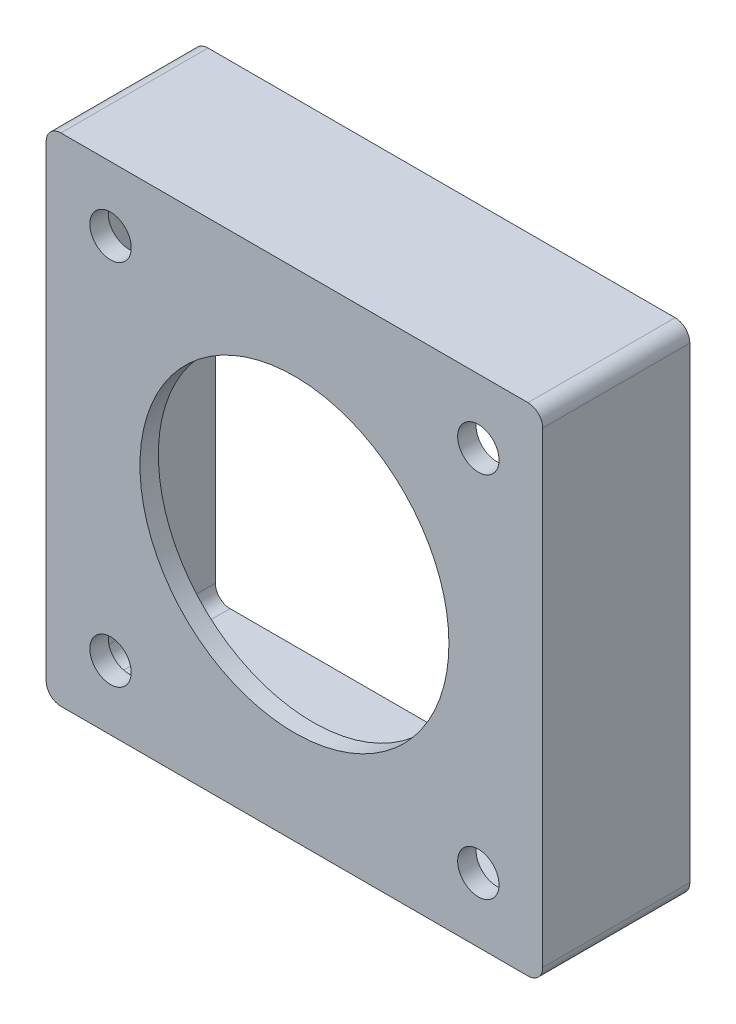
ISO-10303-21;
HEADER;
FILE_DESCRIPTION(('STEP AP214'),'2;1');
FILE_NAME('part.step','',(''),(''),'','','');
FILE_SCHEMA(('AUTOMOTIVE_DESIGN { 1 0 10303 214 1 1 1 1 }'));
ENDSEC;
DATA;
#1=APPLICATION_CONTEXT('core data for automotive mechanical design processes');
#2=APPLICATION_PROTOCOL_DEFINITION('international standard','automotive_design',2000,#1);
#3=PRODUCT_CONTEXT('',#1,'mechanical');
#4=PRODUCT('Part','Part','',(#3));
#5=PRODUCT_RELATED_PRODUCT_CATEGORY('part','',(#4));
#6=PRODUCT_DEFINITION_FORMATION('','',#4);
#7=PRODUCT_DEFINITION_CONTEXT('part definition',#1,'design');
#8=PRODUCT_DEFINITION('design','',#6,#7);
#9=PRODUCT_DEFINITION_SHAPE('','',#8);
#10=(LENGTH_UNIT() NAMED_UNIT(*) SI_UNIT(.MILLI.,.METRE.));
#11=(NAMED_UNIT(*) PLANE_ANGLE_UNIT() SI_UNIT($,.RADIAN.));
#12=(NAMED_UNIT(*) SI_UNIT($,.STERADIAN.) SOLID_ANGLE_UNIT());
#13=UNCERTAINTY_MEASURE_WITH_UNIT(LENGTH_MEASURE(1.E-05),#10,'distance_accuracy_value','');
#14=(GEOMETRIC_REPRESENTATION_CONTEXT(3) GLOBAL_UNCERTAINTY_ASSIGNED_CONTEXT((#13)) GLOBAL_UNIT_ASSIGNED_CONTEXT((#10,
#11,#12)) REPRESENTATION_CONTEXT('',''));
#15=CARTESIAN_POINT('',(0.,0.,0.));
#16=DIRECTION('',(0.,0.,1.));
#17=DIRECTION('',(1.,0.,0.));
#18=AXIS2_PLACEMENT_3D('',#15,#16,#17);
#19=CARTESIAN_POINT('',(0.,0.,25.4));
#20=DIRECTION('',(0.,0.,1.));
#21=DIRECTION('',(1.,0.,0.));
#22=AXIS2_PLACEMENT_3D('',#19,#20,#21);
#23=PLANE('',#22);
#24=CARTESIAN_POINT('',(31.75,31.7499999999996,25.4));
#25=DIRECTION('',(0.,0.,-1.));
#26=DIRECTION('',(-1.,0.,0.));
#27=AXIS2_PLACEMENT_3D('',#24,#25,#26);
#28=CIRCLE('',#27,3.57245345743552);
#29=CARTESIAN_POINT('',(28.1775465425645,31.7499999999996,25.4));
#30=VERTEX_POINT('',#29);
#31=EDGE_CURVE('E295',#30,#30,#28,.T.);
#32=ORIENTED_EDGE('',*,*,#31,.T.);
#33=EDGE_LOOP('',(#32));
#34=FACE_BOUND('',#33,.T.);
#35=CARTESIAN_POINT('',(-31.75,31.7499999999996,25.4));
#36=DIRECTION('',(0.,0.,1.));
#37=DIRECTION('',(1.,0.,0.));
#38=AXIS2_PLACEMENT_3D('',#35,#36,#37);
#39=CIRCLE('',#38,3.57245345743552);
#40=CARTESIAN_POINT('',(-28.1775465425645,31.7499999999996,25.4));
#41=VERTEX_POINT('',#40);
#42=EDGE_CURVE('E298',#41,#41,#39,.T.);
#43=ORIENTED_EDGE('',*,*,#42,.F.);
#44=EDGE_LOOP('',(#43));
#45=FACE_BOUND('',#44,.T.);
#46=DIRECTION('',(1.,0.,0.));
#47=VECTOR('',#46,1.);
#48=CARTESIAN_POINT('',(-42.8625,-42.8625,25.4));
#49=LINE('',#48,#47);
#50=CARTESIAN_POINT('',(-40.3225,-42.8625,25.4));
#51=VERTEX_POINT('',#50);
#52=CARTESIAN_POINT('',(40.3225,-42.8625,25.4));
#53=VERTEX_POINT('',#52);
#54=EDGE_CURVE('E306',#51,#53,#49,.T.);
#55=ORIENTED_EDGE('',*,*,#54,.T.);
#56=CARTESIAN_POINT('',(40.3225,-40.3225,25.4));
#57=DIRECTION('',(0.,0.,1.));
#58=DIRECTION('',(1.,0.,0.));
#59=AXIS2_PLACEMENT_3D('',#56,#57,#58);
#60=CIRCLE('',#59,2.54);
#61=CARTESIAN_POINT('',(42.8625,-40.3225,25.4));
#62=VERTEX_POINT('',#61);
#63=EDGE_CURVE('E209',#53,#62,#60,.T.);
#64=ORIENTED_EDGE('',*,*,#63,.T.);
#65=DIRECTION('',(0.,1.,0.));
#66=VECTOR('',#65,1.);
#67=CARTESIAN_POINT('',(42.8625,42.8625,25.4));
#68=LINE('',#67,#66);
#69=CARTESIAN_POINT('',(42.8625,40.3225,25.4));
#70=VERTEX_POINT('',#69);
#71=EDGE_CURVE('E173',#62,#70,#68,.T.);
#72=ORIENTED_EDGE('',*,*,#71,.T.);
#73=CARTESIAN_POINT('',(40.3225,40.3225,25.4));
#74=DIRECTION('',(0.,0.,1.));
#75=DIRECTION('',(1.,0.,0.));
#76=AXIS2_PLACEMENT_3D('',#73,#74,#75);
#77=CIRCLE('',#76,2.54);
#78=CARTESIAN_POINT('',(40.3225,42.8625,25.4));
#79=VERTEX_POINT('',#78);
#80=EDGE_CURVE('E203',#70,#79,#77,.T.);
#81=ORIENTED_EDGE('',*,*,#80,.T.);
#82=DIRECTION('',(-1.,0.,0.));
#83=VECTOR('',#82,1.);
#84=CARTESIAN_POINT('',(-42.8625,42.8625,25.4));
#85=LINE('',#84,#83);
#86=CARTESIAN_POINT('',(-40.3225,42.8625,25.4));
#87=VERTEX_POINT('',#86);
#88=EDGE_CURVE('E194',#79,#87,#85,.T.);
#89=ORIENTED_EDGE('',*,*,#88,.T.);
#90=CARTESIAN_POINT('',(-40.3225,40.3225,25.4));
#91=DIRECTION('',(0.,0.,1.));
#92=DIRECTION('',(1.,0.,0.));
#93=AXIS2_PLACEMENT_3D('',#90,#91,#92);
#94=CIRCLE('',#93,2.54);
#95=CARTESIAN_POINT('',(-42.8625,40.3225,25.4));
#96=VERTEX_POINT('',#95);
#97=EDGE_CURVE('E205',#87,#96,#94,.T.);
#98=ORIENTED_EDGE('',*,*,#97,.T.);
#99=DIRECTION('',(0.,-1.,0.));
#100=VECTOR('',#99,1.);
#101=CARTESIAN_POINT('',(-42.8625,42.8625,25.4));
#102=LINE('',#101,#100);
#103=CARTESIAN_POINT('',(-42.8625,-40.3225,25.4));
#104=VERTEX_POINT('',#103);
#105=EDGE_CURVE('E183',#96,#104,#102,.T.);
#106=ORIENTED_EDGE('',*,*,#105,.T.);
#107=CARTESIAN_POINT('',(-40.3225,-40.3225,25.4));
#108=DIRECTION('',(0.,0.,1.));
#109=DIRECTION('',(1.,0.,0.));
#110=AXIS2_PLACEMENT_3D('',#107,#108,#109);
#111=CIRCLE('',#110,2.54);
#112=EDGE_CURVE('E207',#104,#51,#111,.T.);
#113=ORIENTED_EDGE('',*,*,#112,.T.);
#114=EDGE_LOOP('',(#55,#64,#72,#81,#89,#98,#106,#113));
#115=FACE_BOUND('',#114,.T.);
#116=CARTESIAN_POINT('',(0.,0.,25.4));
#117=DIRECTION('',(0.,0.,1.));
#118=DIRECTION('',(1.,0.,0.));
#119=AXIS2_PLACEMENT_3D('',#116,#117,#118);
#120=CIRCLE('',#119,26.67);
#121=CARTESIAN_POINT('',(26.67,0.,25.4));
#122=VERTEX_POINT('',#121);
#123=EDGE_CURVE('E301',#122,#122,#120,.T.);
#124=ORIENTED_EDGE('',*,*,#123,.F.);
#125=EDGE_LOOP('',(#124));
#126=FACE_BOUND('',#125,.T.);
#127=CARTESIAN_POINT('',(31.75,-31.7499999999996,25.4));
#128=DIRECTION('',(0.,0.,1.));
#129=DIRECTION('',(-1.,0.,0.));
#130=AXIS2_PLACEMENT_3D('',#127,#128,#129);
#131=CIRCLE('',#130,3.57245345743552);
#132=CARTESIAN_POINT('',(28.1775465425645,-31.7499999999996,25.4));
#133=VERTEX_POINT('',#132);
#134=EDGE_CURVE('E292',#133,#133,#131,.T.);
#135=ORIENTED_EDGE('',*,*,#134,.F.);
#136=EDGE_LOOP('',(#135));
#137=FACE_BOUND('',#136,.T.);
#138=CARTESIAN_POINT('',(-31.75,-31.7499999999996,25.4));
#139=DIRECTION('',(0.,0.,-1.));
#140=DIRECTION('',(1.,0.,0.));
#141=AXIS2_PLACEMENT_3D('',#138,#139,#140);
#142=CIRCLE('',#141,3.57245345743552);
#143=CARTESIAN_POINT('',(-28.1775465425645,-31.7499999999996,25.4));
#144=VERTEX_POINT('',#143);
#145=EDGE_CURVE('E289',#144,#144,#142,.T.);
#146=ORIENTED_EDGE('',*,*,#145,.T.);
#147=EDGE_LOOP('',(#146));
#148=FACE_BOUND('',#147,.T.);
#149=ADVANCED_FACE('F39',(#34,#45,#115,#126,#137,#148),#23,.T.);
#150=CARTESIAN_POINT('',(0.,0.,0.));
#151=DIRECTION('',(0.,0.,1.));
#152=DIRECTION('',(1.,0.,0.));
#153=AXIS2_PLACEMENT_3D('',#150,#151,#152);
#154=PLANE('',#153);
#155=DIRECTION('',(0.,1.,0.));
#156=VECTOR('',#155,1.);
#157=CARTESIAN_POINT('',(-39.0525,39.0525,0.));
#158=LINE('',#157,#156);
#159=CARTESIAN_POINT('',(-39.0525,-36.5125,0.));
#160=VERTEX_POINT('',#159);
#161=CARTESIAN_POINT('',(-39.0525,36.5125,0.));
#162=VERTEX_POINT('',#161);
#163=EDGE_CURVE('E255',#160,#162,#158,.T.);
#164=ORIENTED_EDGE('',*,*,#163,.F.);
#165=CARTESIAN_POINT('',(-36.5125,-36.5125,0.));
#166=DIRECTION('',(0.,0.,1.));
#167=DIRECTION('',(1.,0.,0.));
#168=AXIS2_PLACEMENT_3D('',#165,#166,#167);
#169=CIRCLE('',#168,2.54);
#170=CARTESIAN_POINT('',(-36.5125,-39.0525,0.));
#171=VERTEX_POINT('',#170);
#172=EDGE_CURVE('E47',#160,#171,#169,.T.);
#173=ORIENTED_EDGE('',*,*,#172,.T.);
#174=DIRECTION('',(-1.,0.,0.));
#175=VECTOR('',#174,1.);
#176=CARTESIAN_POINT('',(39.0525,-39.0525,0.));
#177=LINE('',#176,#175);
#178=CARTESIAN_POINT('',(36.5125,-39.0525,0.));
#179=VERTEX_POINT('',#178);
#180=EDGE_CURVE('E254',#179,#171,#177,.T.);
#181=ORIENTED_EDGE('',*,*,#180,.F.);
#182=CARTESIAN_POINT('',(36.5125,-36.5125,0.));
#183=DIRECTION('',(0.,0.,1.));
#184=DIRECTION('',(1.,0.,0.));
#185=AXIS2_PLACEMENT_3D('',#182,#183,#184);
#186=CIRCLE('',#185,2.54);
#187=CARTESIAN_POINT('',(39.0525,-36.5125,0.));
#188=VERTEX_POINT('',#187);
#189=EDGE_CURVE('E249',#179,#188,#186,.T.);
#190=ORIENTED_EDGE('',*,*,#189,.T.);
#191=DIRECTION('',(0.,-1.,0.));
#192=VECTOR('',#191,1.);
#193=CARTESIAN_POINT('',(39.0525,39.0525,0.));
#194=LINE('',#193,#192);
#195=CARTESIAN_POINT('',(39.0525,36.5125,0.));
#196=VERTEX_POINT('',#195);
#197=EDGE_CURVE('E263',#196,#188,#194,.T.);
#198=ORIENTED_EDGE('',*,*,#197,.F.);
#199=CARTESIAN_POINT('',(36.5125,36.5125,0.));
#200=DIRECTION('',(0.,0.,1.));
#201=DIRECTION('',(1.,0.,0.));
#202=AXIS2_PLACEMENT_3D('',#199,#200,#201);
#203=CIRCLE('',#202,2.54);
#204=CARTESIAN_POINT('',(36.5125,39.0525,0.));
#205=VERTEX_POINT('',#204);
#206=EDGE_CURVE('E247',#196,#205,#203,.T.);
#207=ORIENTED_EDGE('',*,*,#206,.T.);
#208=DIRECTION('',(1.,0.,0.));
#209=VECTOR('',#208,1.);
#210=CARTESIAN_POINT('',(39.0525,39.0525,0.));
#211=LINE('',#210,#209);
#212=CARTESIAN_POINT('',(-36.5125,39.0525,0.));
#213=VERTEX_POINT('',#212);
#214=EDGE_CURVE('E274',#213,#205,#211,.T.);
#215=ORIENTED_EDGE('',*,*,#214,.F.);
#216=CARTESIAN_POINT('',(-36.5125,36.5125,0.));
#217=DIRECTION('',(0.,0.,1.));
#218=DIRECTION('',(1.,0.,0.));
#219=AXIS2_PLACEMENT_3D('',#216,#217,#218);
#220=CIRCLE('',#219,2.54);
#221=EDGE_CURVE('E12',#213,#162,#220,.T.);
#222=ORIENTED_EDGE('',*,*,#221,.T.);
#223=EDGE_LOOP('',(#164,#173,#181,#190,#198,#207,#215,#222));
#224=FACE_BOUND('',#223,.T.);
#225=DIRECTION('',(0.,1.,0.));
#226=VECTOR('',#225,1.);
#227=CARTESIAN_POINT('',(42.8625,42.8625,0.));
#228=LINE('',#227,#226);
#229=CARTESIAN_POINT('',(42.8625,-40.3225,0.));
#230=VERTEX_POINT('',#229);
#231=CARTESIAN_POINT('',(42.8625,40.3225,0.));
#232=VERTEX_POINT('',#231);
#233=EDGE_CURVE('E170',#230,#232,#228,.T.);
#234=ORIENTED_EDGE('',*,*,#233,.F.);
#235=CARTESIAN_POINT('',(40.3225,-40.3225,0.));
#236=DIRECTION('',(0.,0.,1.));
#237=DIRECTION('',(1.,0.,0.));
#238=AXIS2_PLACEMENT_3D('',#235,#236,#237);
#239=CIRCLE('',#238,2.54);
#240=CARTESIAN_POINT('',(40.3225,-42.8625,0.));
#241=VERTEX_POINT('',#240);
#242=EDGE_CURVE('E153',#230,#241,#239,.F.);
#243=ORIENTED_EDGE('',*,*,#242,.T.);
#244=DIRECTION('',(1.,0.,0.));
#245=VECTOR('',#244,1.);
#246=CARTESIAN_POINT('',(-42.8625,-42.8625,0.));
#247=LINE('',#246,#245);
#248=CARTESIAN_POINT('',(-40.3225,-42.8625,0.));
#249=VERTEX_POINT('',#248);
#250=EDGE_CURVE('E180',#249,#241,#247,.T.);
#251=ORIENTED_EDGE('',*,*,#250,.F.);
#252=CARTESIAN_POINT('',(-40.3225,-40.3225,0.));
#253=DIRECTION('',(0.,0.,1.));
#254=DIRECTION('',(1.,0.,0.));
#255=AXIS2_PLACEMENT_3D('',#252,#253,#254);
#256=CIRCLE('',#255,2.54);
#257=CARTESIAN_POINT('',(-42.8625,-40.3225,0.));
#258=VERTEX_POINT('',#257);
#259=EDGE_CURVE('E164',#249,#258,#256,.F.);
#260=ORIENTED_EDGE('',*,*,#259,.T.);
#261=DIRECTION('',(0.,-1.,0.));
#262=VECTOR('',#261,1.);
#263=CARTESIAN_POINT('',(-42.8625,42.8625,0.));
#264=LINE('',#263,#262);
#265=CARTESIAN_POINT('',(-42.8625,40.3225,0.));
#266=VERTEX_POINT('',#265);
#267=EDGE_CURVE('E185',#266,#258,#264,.T.);
#268=ORIENTED_EDGE('',*,*,#267,.F.);
#269=CARTESIAN_POINT('',(-40.3225,40.3225,0.));
#270=DIRECTION('',(0.,0.,1.));
#271=DIRECTION('',(1.,0.,0.));
#272=AXIS2_PLACEMENT_3D('',#269,#270,#271);
#273=CIRCLE('',#272,2.54);
#274=CARTESIAN_POINT('',(-40.3225,42.8625,0.));
#275=VERTEX_POINT('',#274);
#276=EDGE_CURVE('E197',#266,#275,#273,.F.);
#277=ORIENTED_EDGE('',*,*,#276,.T.);
#278=DIRECTION('',(-1.,0.,0.));
#279=VECTOR('',#278,1.);
#280=CARTESIAN_POINT('',(-42.8625,42.8625,0.));
#281=LINE('',#280,#279);
#282=CARTESIAN_POINT('',(40.3225,42.8625,0.));
#283=VERTEX_POINT('',#282);
#284=EDGE_CURVE('E179',#283,#275,#281,.T.);
#285=ORIENTED_EDGE('',*,*,#284,.F.);
#286=CARTESIAN_POINT('',(40.3225,40.3225,0.));
#287=DIRECTION('',(0.,0.,1.));
#288=DIRECTION('',(1.,0.,0.));
#289=AXIS2_PLACEMENT_3D('',#286,#287,#288);
#290=CIRCLE('',#289,2.54);
#291=EDGE_CURVE('E174',#283,#232,#290,.F.);
#292=ORIENTED_EDGE('',*,*,#291,.T.);
#293=EDGE_LOOP('',(#234,#243,#251,#260,#268,#277,#285,#292));
#294=FACE_BOUND('',#293,.T.);
#295=ADVANCED_FACE('F177',(#224,#294),#154,.F.);
#296=CARTESIAN_POINT('',(-42.8625,42.8625,25.4));
#297=DIRECTION('',(1.,0.,0.));
#298=DIRECTION('',(0.,1.,0.));
#299=AXIS2_PLACEMENT_3D('',#296,#297,#298);
#300=PLANE('',#299);
#301=ORIENTED_EDGE('',*,*,#267,.T.);
#302=DIRECTION('',(0.,0.,-1.));
#303=VECTOR('',#302,1.);
#304=CARTESIAN_POINT('',(-42.8625,-40.3225,25.4));
#305=LINE('',#304,#303);
#306=EDGE_CURVE('E214',#258,#104,#305,.F.);
#307=ORIENTED_EDGE('',*,*,#306,.T.);
#308=ORIENTED_EDGE('',*,*,#105,.F.);
#309=DIRECTION('',(0.,0.,-1.));
#310=VECTOR('',#309,1.);
#311=CARTESIAN_POINT('',(-42.8625,40.3225,25.4));
#312=LINE('',#311,#310);
#313=EDGE_CURVE('E211',#96,#266,#312,.T.);
#314=ORIENTED_EDGE('',*,*,#313,.T.);
#315=EDGE_LOOP('',(#301,#307,#308,#314));
#316=FACE_BOUND('',#315,.T.);
#317=ADVANCED_FACE('F315',(#316),#300,.F.);
#318=CARTESIAN_POINT('',(-42.8625,-42.8625,25.4));
#319=DIRECTION('',(0.,1.,0.));
#320=DIRECTION('',(-1.,0.,0.));
#321=AXIS2_PLACEMENT_3D('',#318,#319,#320);
#322=PLANE('',#321);
#323=ORIENTED_EDGE('',*,*,#250,.T.);
#324=DIRECTION('',(0.,0.,-1.));
#325=VECTOR('',#324,1.);
#326=CARTESIAN_POINT('',(40.3225,-42.8625,25.4));
#327=LINE('',#326,#325);
#328=EDGE_CURVE('E158',#241,#53,#327,.F.);
#329=ORIENTED_EDGE('',*,*,#328,.T.);
#330=ORIENTED_EDGE('',*,*,#54,.F.);
#331=DIRECTION('',(0.,0.,-1.));
#332=VECTOR('',#331,1.);
#333=CARTESIAN_POINT('',(-40.3225,-42.8625,25.4));
#334=LINE('',#333,#332);
#335=EDGE_CURVE('E163',#51,#249,#334,.T.);
#336=ORIENTED_EDGE('',*,*,#335,.T.);
#337=EDGE_LOOP('',(#323,#329,#330,#336));
#338=FACE_BOUND('',#337,.T.);
#339=ADVANCED_FACE('F326',(#338),#322,.F.);
#340=CARTESIAN_POINT('',(42.8625,42.8625,25.4));
#341=DIRECTION('',(-1.,0.,0.));
#342=DIRECTION('',(0.,-1.,0.));
#343=AXIS2_PLACEMENT_3D('',#340,#341,#342);
#344=PLANE('',#343);
#345=ORIENTED_EDGE('',*,*,#71,.F.);
#346=DIRECTION('',(0.,0.,-1.));
#347=VECTOR('',#346,1.);
#348=CARTESIAN_POINT('',(42.8625,-40.3225,25.4));
#349=LINE('',#348,#347);
#350=EDGE_CURVE('E157',#62,#230,#349,.T.);
#351=ORIENTED_EDGE('',*,*,#350,.T.);
#352=ORIENTED_EDGE('',*,*,#233,.T.);
#353=DIRECTION('',(0.,0.,-1.));
#354=VECTOR('',#353,1.);
#355=CARTESIAN_POINT('',(42.8625,40.3225,25.4));
#356=LINE('',#355,#354);
#357=EDGE_CURVE('E175',#232,#70,#356,.F.);
#358=ORIENTED_EDGE('',*,*,#357,.T.);
#359=EDGE_LOOP('',(#345,#351,#352,#358));
#360=FACE_BOUND('',#359,.T.);
#361=ADVANCED_FACE('F169',(#360),#344,.F.);
#362=CARTESIAN_POINT('',(-42.8625,42.8625,25.4));
#363=DIRECTION('',(0.,-1.,0.));
#364=DIRECTION('',(0.,0.,-1.));
#365=AXIS2_PLACEMENT_3D('',#362,#363,#364);
#366=PLANE('',#365);
#367=ORIENTED_EDGE('',*,*,#284,.T.);
#368=DIRECTION('',(0.,0.,-1.));
#369=VECTOR('',#368,1.);
#370=CARTESIAN_POINT('',(-40.3225,42.8625,25.4));
#371=LINE('',#370,#369);
#372=EDGE_CURVE('E219',#275,#87,#371,.F.);
#373=ORIENTED_EDGE('',*,*,#372,.T.);
#374=ORIENTED_EDGE('',*,*,#88,.F.);
#375=DIRECTION('',(0.,0.,-1.));
#376=VECTOR('',#375,1.);
#377=CARTESIAN_POINT('',(40.3225,42.8625,25.4));
#378=LINE('',#377,#376);
#379=EDGE_CURVE('E216',#79,#283,#378,.T.);
#380=ORIENTED_EDGE('',*,*,#379,.T.);
#381=EDGE_LOOP('',(#367,#373,#374,#380));
#382=FACE_BOUND('',#381,.T.);
#383=ADVANCED_FACE('F333',(#382),#366,.F.);
#384=CARTESIAN_POINT('',(0.,0.,25.4));
#385=DIRECTION('',(0.,0.,-1.));
#386=DIRECTION('',(-1.,0.,0.));
#387=AXIS2_PLACEMENT_3D('',#384,#385,#386);
#388=CYLINDRICAL_SURFACE('',#387,26.67);
#389=CARTESIAN_POINT('',(0.,0.,22.225));
#390=DIRECTION('',(0.,0.,1.));
#391=DIRECTION('',(1.,0.,0.));
#392=AXIS2_PLACEMENT_3D('',#389,#390,#391);
#393=CIRCLE('',#392,26.67);
#394=CARTESIAN_POINT('',(26.67,0.,22.225));
#395=VERTEX_POINT('',#394);
#396=EDGE_CURVE('E286',#395,#395,#393,.T.);
#397=ORIENTED_EDGE('',*,*,#396,.F.);
#398=EDGE_LOOP('',(#397));
#399=FACE_BOUND('',#398,.T.);
#400=ORIENTED_EDGE('',*,*,#123,.T.);
#401=EDGE_LOOP('',(#400));
#402=FACE_BOUND('',#401,.T.);
#403=ADVANCED_FACE('F345',(#399,#402),#388,.F.);
#404=CARTESIAN_POINT('',(-31.75,31.7499999999996,0.));
#405=DIRECTION('',(0.,0.,1.));
#406=DIRECTION('',(1.,0.,0.));
#407=AXIS2_PLACEMENT_3D('',#404,#405,#406);
#408=CYLINDRICAL_SURFACE('',#407,3.57245345743552);
#409=CARTESIAN_POINT('',(-31.75,31.7499999999996,22.225));
#410=DIRECTION('',(0.,0.,1.));
#411=DIRECTION('',(1.,0.,0.));
#412=AXIS2_PLACEMENT_3D('',#409,#410,#411);
#413=CIRCLE('',#412,3.57245345743552);
#414=CARTESIAN_POINT('',(-28.1775465425645,31.7499999999996,22.225));
#415=VERTEX_POINT('',#414);
#416=EDGE_CURVE('E283',#415,#415,#413,.F.);
#417=ORIENTED_EDGE('',*,*,#416,.T.);
#418=EDGE_LOOP('',(#417));
#419=FACE_BOUND('',#418,.T.);
#420=ORIENTED_EDGE('',*,*,#42,.T.);
#421=EDGE_LOOP('',(#420));
#422=FACE_BOUND('',#421,.T.);
#423=ADVANCED_FACE('F353',(#419,#422),#408,.F.);
#424=CARTESIAN_POINT('',(31.75,31.7499999999996,0.));
#425=DIRECTION('',(0.,0.,1.));
#426=DIRECTION('',(1.,0.,0.));
#427=AXIS2_PLACEMENT_3D('',#424,#425,#426);
#428=CYLINDRICAL_SURFACE('',#427,3.57245345743552);
#429=CARTESIAN_POINT('',(31.75,31.7499999999996,22.225));
#430=DIRECTION('',(0.,0.,1.));
#431=DIRECTION('',(1.,0.,0.));
#432=AXIS2_PLACEMENT_3D('',#429,#430,#431);
#433=CIRCLE('',#432,3.57245345743552);
#434=CARTESIAN_POINT('',(35.3224534574355,31.7499999999996,22.225));
#435=VERTEX_POINT('',#434);
#436=EDGE_CURVE('E280',#435,#435,#433,.T.);
#437=ORIENTED_EDGE('',*,*,#436,.F.);
#438=EDGE_LOOP('',(#437));
#439=FACE_BOUND('',#438,.T.);
#440=ORIENTED_EDGE('',*,*,#31,.F.);
#441=EDGE_LOOP('',(#440));
#442=FACE_BOUND('',#441,.T.);
#443=ADVANCED_FACE('F431',(#439,#442),#428,.F.);
#444=CARTESIAN_POINT('',(31.75,-31.7499999999996,0.));
#445=DIRECTION('',(0.,0.,1.));
#446=DIRECTION('',(1.,0.,0.));
#447=AXIS2_PLACEMENT_3D('',#444,#445,#446);
#448=CYLINDRICAL_SURFACE('',#447,3.57245345743552);
#449=CARTESIAN_POINT('',(31.75,-31.7499999999996,22.225));
#450=DIRECTION('',(0.,0.,1.));
#451=DIRECTION('',(1.,0.,0.));
#452=AXIS2_PLACEMENT_3D('',#449,#450,#451);
#453=CIRCLE('',#452,3.57245345743552);
#454=CARTESIAN_POINT('',(35.3224534574355,-31.7499999999996,22.225));
#455=VERTEX_POINT('',#454);
#456=EDGE_CURVE('E192',#455,#455,#453,.F.);
#457=ORIENTED_EDGE('',*,*,#456,.T.);
#458=EDGE_LOOP('',(#457));
#459=FACE_BOUND('',#458,.T.);
#460=ORIENTED_EDGE('',*,*,#134,.T.);
#461=EDGE_LOOP('',(#460));
#462=FACE_BOUND('',#461,.T.);
#463=ADVANCED_FACE('F427',(#459,#462),#448,.F.);
#464=CARTESIAN_POINT('',(-31.75,-31.7499999999996,0.));
#465=DIRECTION('',(0.,0.,1.));
#466=DIRECTION('',(1.,0.,0.));
#467=AXIS2_PLACEMENT_3D('',#464,#465,#466);
#468=CYLINDRICAL_SURFACE('',#467,3.57245345743552);
#469=CARTESIAN_POINT('',(-31.75,-31.7499999999996,22.225));
#470=DIRECTION('',(0.,0.,1.));
#471=DIRECTION('',(1.,0.,0.));
#472=AXIS2_PLACEMENT_3D('',#469,#470,#471);
#473=CIRCLE('',#472,3.57245345743552);
#474=CARTESIAN_POINT('',(-28.1775465425645,-31.7499999999996,22.225));
#475=VERTEX_POINT('',#474);
#476=EDGE_CURVE('E189',#475,#475,#473,.T.);
#477=ORIENTED_EDGE('',*,*,#476,.F.);
#478=EDGE_LOOP('',(#477));
#479=FACE_BOUND('',#478,.T.);
#480=ORIENTED_EDGE('',*,*,#145,.F.);
#481=EDGE_LOOP('',(#480));
#482=FACE_BOUND('',#481,.T.);
#483=ADVANCED_FACE('F423',(#479,#482),#468,.F.);
#484=CARTESIAN_POINT('',(0.,0.,22.225));
#485=DIRECTION('',(0.,0.,1.));
#486=DIRECTION('',(1.,0.,0.));
#487=AXIS2_PLACEMENT_3D('',#484,#485,#486);
#488=PLANE('',#487);
#489=ORIENTED_EDGE('',*,*,#396,.T.);
#490=EDGE_LOOP('',(#489));
#491=FACE_BOUND('',#490,.T.);
#492=ORIENTED_EDGE('',*,*,#456,.F.);
#493=EDGE_LOOP('',(#492));
#494=FACE_BOUND('',#493,.T.);
#495=ORIENTED_EDGE('',*,*,#476,.T.);
#496=EDGE_LOOP('',(#495));
#497=FACE_BOUND('',#496,.T.);
#498=DIRECTION('',(1.,0.,0.));
#499=VECTOR('',#498,1.);
#500=CARTESIAN_POINT('',(39.0525,39.0525,22.225));
#501=LINE('',#500,#499);
#502=CARTESIAN_POINT('',(-36.5125,39.0525,22.225));
#503=VERTEX_POINT('',#502);
#504=CARTESIAN_POINT('',(36.5125,39.0525,22.225));
#505=VERTEX_POINT('',#504);
#506=EDGE_CURVE('E269',#503,#505,#501,.T.);
#507=ORIENTED_EDGE('',*,*,#506,.T.);
#508=CARTESIAN_POINT('',(36.5125,36.5125,22.225));
#509=DIRECTION('',(0.,0.,1.));
#510=DIRECTION('',(1.,0.,0.));
#511=AXIS2_PLACEMENT_3D('',#508,#509,#510);
#512=CIRCLE('',#511,2.54);
#513=CARTESIAN_POINT('',(39.0525,36.5125,22.225));
#514=VERTEX_POINT('',#513);
#515=EDGE_CURVE('E236',#505,#514,#512,.F.);
#516=ORIENTED_EDGE('',*,*,#515,.T.);
#517=DIRECTION('',(0.,-1.,0.));
#518=VECTOR('',#517,1.);
#519=CARTESIAN_POINT('',(39.0525,39.0525,22.225));
#520=LINE('',#519,#518);
#521=CARTESIAN_POINT('',(39.0525,-36.5125,22.225));
#522=VERTEX_POINT('',#521);
#523=EDGE_CURVE('E193',#514,#522,#520,.T.);
#524=ORIENTED_EDGE('',*,*,#523,.T.);
#525=CARTESIAN_POINT('',(36.5125,-36.5125,22.225));
#526=DIRECTION('',(0.,0.,1.));
#527=DIRECTION('',(1.,0.,0.));
#528=AXIS2_PLACEMENT_3D('',#525,#526,#527);
#529=CIRCLE('',#528,2.54);
#530=CARTESIAN_POINT('',(36.5125,-39.0525,22.225));
#531=VERTEX_POINT('',#530);
#532=EDGE_CURVE('E234',#522,#531,#529,.F.);
#533=ORIENTED_EDGE('',*,*,#532,.T.);
#534=DIRECTION('',(-1.,0.,0.));
#535=VECTOR('',#534,1.);
#536=CARTESIAN_POINT('',(39.0525,-39.0525,22.225));
#537=LINE('',#536,#535);
#538=CARTESIAN_POINT('',(-36.5125,-39.0525,22.225));
#539=VERTEX_POINT('',#538);
#540=EDGE_CURVE('E270',#531,#539,#537,.T.);
#541=ORIENTED_EDGE('',*,*,#540,.T.);
#542=CARTESIAN_POINT('',(-36.5125,-36.5125,22.225));
#543=DIRECTION('',(0.,0.,1.));
#544=DIRECTION('',(1.,0.,0.));
#545=AXIS2_PLACEMENT_3D('',#542,#543,#544);
#546=CIRCLE('',#545,2.54);
#547=CARTESIAN_POINT('',(-39.0525,-36.5125,22.225));
#548=VERTEX_POINT('',#547);
#549=EDGE_CURVE('E61',#539,#548,#546,.F.);
#550=ORIENTED_EDGE('',*,*,#549,.T.);
#551=DIRECTION('',(0.,1.,0.));
#552=VECTOR('',#551,1.);
#553=CARTESIAN_POINT('',(-39.0525,39.0525,22.225));
#554=LINE('',#553,#552);
#555=CARTESIAN_POINT('',(-39.0525,36.5125,22.225));
#556=VERTEX_POINT('',#555);
#557=EDGE_CURVE('E267',#548,#556,#554,.T.);
#558=ORIENTED_EDGE('',*,*,#557,.T.);
#559=CARTESIAN_POINT('',(-36.5125,36.5125,22.225));
#560=DIRECTION('',(0.,0.,1.));
#561=DIRECTION('',(1.,0.,0.));
#562=AXIS2_PLACEMENT_3D('',#559,#560,#561);
#563=CIRCLE('',#562,2.54);
#564=EDGE_CURVE('E231',#556,#503,#563,.F.);
#565=ORIENTED_EDGE('',*,*,#564,.T.);
#566=EDGE_LOOP('',(#507,#516,#524,#533,#541,#550,#558,#565));
#567=FACE_BOUND('',#566,.T.);
#568=ORIENTED_EDGE('',*,*,#436,.T.);
#569=EDGE_LOOP('',(#568));
#570=FACE_BOUND('',#569,.T.);
#571=ORIENTED_EDGE('',*,*,#416,.F.);
#572=EDGE_LOOP('',(#571));
#573=FACE_BOUND('',#572,.T.);
#574=ADVANCED_FACE('F388',(#491,#494,#497,#567,#570,#573),#488,.F.);
#575=CARTESIAN_POINT('',(39.0525,-39.0525,135.857150289151));
#576=DIRECTION('',(0.,-1.,0.));
#577=DIRECTION('',(0.,0.,-1.));
#578=AXIS2_PLACEMENT_3D('',#575,#576,#577);
#579=PLANE('',#578);
#580=ORIENTED_EDGE('',*,*,#540,.F.);
#581=DIRECTION('',(0.,0.,-1.));
#582=VECTOR('',#581,1.);
#583=CARTESIAN_POINT('',(36.5125,-39.0525,0.));
#584=LINE('',#583,#582);
#585=EDGE_CURVE('E240',#531,#179,#584,.T.);
#586=ORIENTED_EDGE('',*,*,#585,.T.);
#587=ORIENTED_EDGE('',*,*,#180,.T.);
#588=DIRECTION('',(0.,0.,-1.));
#589=VECTOR('',#588,1.);
#590=CARTESIAN_POINT('',(-36.5125,-39.0525,22.225));
#591=LINE('',#590,#589);
#592=EDGE_CURVE('E238',#171,#539,#591,.F.);
#593=ORIENTED_EDGE('',*,*,#592,.T.);
#594=EDGE_LOOP('',(#580,#586,#587,#593));
#595=FACE_BOUND('',#594,.T.);
#596=ADVANCED_FACE('F261',(#595),#579,.F.);
#597=CARTESIAN_POINT('',(-39.0525,39.0525,135.857150289151));
#598=DIRECTION('',(-1.,0.,0.));
#599=DIRECTION('',(0.,-1.,0.));
#600=AXIS2_PLACEMENT_3D('',#597,#598,#599);
#601=PLANE('',#600);
#602=ORIENTED_EDGE('',*,*,#557,.F.);
#603=DIRECTION('',(0.,0.,-1.));
#604=VECTOR('',#603,1.);
#605=CARTESIAN_POINT('',(-39.0525,-36.5125,0.));
#606=LINE('',#605,#604);
#607=EDGE_CURVE('E244',#548,#160,#606,.T.);
#608=ORIENTED_EDGE('',*,*,#607,.T.);
#609=ORIENTED_EDGE('',*,*,#163,.T.);
#610=DIRECTION('',(0.,0.,-1.));
#611=VECTOR('',#610,1.);
#612=CARTESIAN_POINT('',(-39.0525,36.5125,22.225));
#613=LINE('',#612,#611);
#614=EDGE_CURVE('E54',#162,#556,#613,.F.);
#615=ORIENTED_EDGE('',*,*,#614,.T.);
#616=EDGE_LOOP('',(#602,#608,#609,#615));
#617=FACE_BOUND('',#616,.T.);
#618=ADVANCED_FACE('F266',(#617),#601,.F.);
#619=CARTESIAN_POINT('',(39.0525,39.0525,135.857150289151));
#620=DIRECTION('',(0.,1.,0.));
#621=DIRECTION('',(0.,0.,1.));
#622=AXIS2_PLACEMENT_3D('',#619,#620,#621);
#623=PLANE('',#622);
#624=ORIENTED_EDGE('',*,*,#214,.T.);
#625=DIRECTION('',(0.,0.,-1.));
#626=VECTOR('',#625,1.);
#627=CARTESIAN_POINT('',(36.5125,39.0525,22.225));
#628=LINE('',#627,#626);
#629=EDGE_CURVE('E229',#205,#505,#628,.F.);
#630=ORIENTED_EDGE('',*,*,#629,.T.);
#631=ORIENTED_EDGE('',*,*,#506,.F.);
#632=DIRECTION('',(0.,0.,-1.));
#633=VECTOR('',#632,1.);
#634=CARTESIAN_POINT('',(-36.5125,39.0525,0.));
#635=LINE('',#634,#633);
#636=EDGE_CURVE('E226',#503,#213,#635,.T.);
#637=ORIENTED_EDGE('',*,*,#636,.T.);
#638=EDGE_LOOP('',(#624,#630,#631,#637));
#639=FACE_BOUND('',#638,.T.);
#640=ADVANCED_FACE('F393',(#639),#623,.F.);
#641=CARTESIAN_POINT('',(39.0525,39.0525,135.857150289151));
#642=DIRECTION('',(1.,0.,0.));
#643=DIRECTION('',(0.,1.,0.));
#644=AXIS2_PLACEMENT_3D('',#641,#642,#643);
#645=PLANE('',#644);
#646=ORIENTED_EDGE('',*,*,#523,.F.);
#647=DIRECTION('',(0.,0.,-1.));
#648=VECTOR('',#647,1.);
#649=CARTESIAN_POINT('',(39.0525,36.5125,0.));
#650=LINE('',#649,#648);
#651=EDGE_CURVE('E223',#514,#196,#650,.T.);
#652=ORIENTED_EDGE('',*,*,#651,.T.);
#653=ORIENTED_EDGE('',*,*,#197,.T.);
#654=DIRECTION('',(0.,0.,-1.));
#655=VECTOR('',#654,1.);
#656=CARTESIAN_POINT('',(39.0525,-36.5125,22.225));
#657=LINE('',#656,#655);
#658=EDGE_CURVE('E221',#188,#522,#657,.F.);
#659=ORIENTED_EDGE('',*,*,#658,.T.);
#660=EDGE_LOOP('',(#646,#652,#653,#659));
#661=FACE_BOUND('',#660,.T.);
#662=ADVANCED_FACE('F401',(#661),#645,.F.);
#663=CARTESIAN_POINT('',(40.3225,-40.3225,25.4));
#664=DIRECTION('',(0.,0.,-1.));
#665=DIRECTION('',(-1.,0.,0.));
#666=AXIS2_PLACEMENT_3D('',#663,#664,#665);
#667=CYLINDRICAL_SURFACE('',#666,2.54);
#668=ORIENTED_EDGE('',*,*,#63,.F.);
#669=ORIENTED_EDGE('',*,*,#328,.F.);
#670=ORIENTED_EDGE('',*,*,#242,.F.);
#671=ORIENTED_EDGE('',*,*,#350,.F.);
#672=EDGE_LOOP('',(#668,#669,#670,#671));
#673=FACE_BOUND('',#672,.T.);
#674=ADVANCED_FACE('F156',(#673),#667,.T.);
#675=CARTESIAN_POINT('',(-40.3225,-40.3225,25.4));
#676=DIRECTION('',(0.,0.,-1.));
#677=DIRECTION('',(-1.,0.,0.));
#678=AXIS2_PLACEMENT_3D('',#675,#676,#677);
#679=CYLINDRICAL_SURFACE('',#678,2.54);
#680=ORIENTED_EDGE('',*,*,#112,.F.);
#681=ORIENTED_EDGE('',*,*,#306,.F.);
#682=ORIENTED_EDGE('',*,*,#259,.F.);
#683=ORIENTED_EDGE('',*,*,#335,.F.);
#684=EDGE_LOOP('',(#680,#681,#682,#683));
#685=FACE_BOUND('',#684,.T.);
#686=ADVANCED_FACE('F320',(#685),#679,.T.);
#687=CARTESIAN_POINT('',(-40.3225,40.3225,25.4));
#688=DIRECTION('',(0.,0.,-1.));
#689=DIRECTION('',(-1.,0.,0.));
#690=AXIS2_PLACEMENT_3D('',#687,#688,#689);
#691=CYLINDRICAL_SURFACE('',#690,2.54);
#692=ORIENTED_EDGE('',*,*,#97,.F.);
#693=ORIENTED_EDGE('',*,*,#372,.F.);
#694=ORIENTED_EDGE('',*,*,#276,.F.);
#695=ORIENTED_EDGE('',*,*,#313,.F.);
#696=EDGE_LOOP('',(#692,#693,#694,#695));
#697=FACE_BOUND('',#696,.T.);
#698=ADVANCED_FACE('F360',(#697),#691,.T.);
#699=CARTESIAN_POINT('',(40.3225,40.3225,25.4));
#700=DIRECTION('',(0.,0.,-1.));
#701=DIRECTION('',(-1.,0.,0.));
#702=AXIS2_PLACEMENT_3D('',#699,#700,#701);
#703=CYLINDRICAL_SURFACE('',#702,2.54);
#704=ORIENTED_EDGE('',*,*,#80,.F.);
#705=ORIENTED_EDGE('',*,*,#357,.F.);
#706=ORIENTED_EDGE('',*,*,#291,.F.);
#707=ORIENTED_EDGE('',*,*,#379,.F.);
#708=EDGE_LOOP('',(#704,#705,#706,#707));
#709=FACE_BOUND('',#708,.T.);
#710=ADVANCED_FACE('F363',(#709),#703,.T.);
#711=CARTESIAN_POINT('',(36.5125,36.5125,135.857150289151));
#712=DIRECTION('',(0.,0.,1.));
#713=DIRECTION('',(1.,0.,0.));
#714=AXIS2_PLACEMENT_3D('',#711,#712,#713);
#715=CYLINDRICAL_SURFACE('',#714,2.54);
#716=ORIENTED_EDGE('',*,*,#515,.F.);
#717=ORIENTED_EDGE('',*,*,#629,.F.);
#718=ORIENTED_EDGE('',*,*,#206,.F.);
#719=ORIENTED_EDGE('',*,*,#651,.F.);
#720=EDGE_LOOP('',(#716,#717,#718,#719));
#721=FACE_BOUND('',#720,.T.);
#722=ADVANCED_FACE('F365',(#721),#715,.F.);
#723=CARTESIAN_POINT('',(36.5125,-36.5125,135.857150289151));
#724=DIRECTION('',(0.,0.,1.));
#725=DIRECTION('',(1.,0.,0.));
#726=AXIS2_PLACEMENT_3D('',#723,#724,#725);
#727=CYLINDRICAL_SURFACE('',#726,2.54);
#728=ORIENTED_EDGE('',*,*,#532,.F.);
#729=ORIENTED_EDGE('',*,*,#658,.F.);
#730=ORIENTED_EDGE('',*,*,#189,.F.);
#731=ORIENTED_EDGE('',*,*,#585,.F.);
#732=EDGE_LOOP('',(#728,#729,#730,#731));
#733=FACE_BOUND('',#732,.T.);
#734=ADVANCED_FACE('F371',(#733),#727,.F.);
#735=CARTESIAN_POINT('',(-36.5125,-36.5125,135.857150289151));
#736=DIRECTION('',(0.,0.,1.));
#737=DIRECTION('',(1.,0.,0.));
#738=AXIS2_PLACEMENT_3D('',#735,#736,#737);
#739=CYLINDRICAL_SURFACE('',#738,2.54);
#740=ORIENTED_EDGE('',*,*,#549,.F.);
#741=ORIENTED_EDGE('',*,*,#592,.F.);
#742=ORIENTED_EDGE('',*,*,#172,.F.);
#743=ORIENTED_EDGE('',*,*,#607,.F.);
#744=EDGE_LOOP('',(#740,#741,#742,#743));
#745=FACE_BOUND('',#744,.T.);
#746=ADVANCED_FACE('F265',(#745),#739,.F.);
#747=CARTESIAN_POINT('',(-36.5125,36.5125,135.857150289151));
#748=DIRECTION('',(0.,0.,1.));
#749=DIRECTION('',(1.,0.,0.));
#750=AXIS2_PLACEMENT_3D('',#747,#748,#749);
#751=CYLINDRICAL_SURFACE('',#750,2.54);
#752=ORIENTED_EDGE('',*,*,#564,.F.);
#753=ORIENTED_EDGE('',*,*,#614,.F.);
#754=ORIENTED_EDGE('',*,*,#221,.F.);
#755=ORIENTED_EDGE('',*,*,#636,.F.);
#756=EDGE_LOOP('',(#752,#753,#754,#755));
#757=FACE_BOUND('',#756,.T.);
#758=ADVANCED_FACE('F41',(#757),#751,.F.);
#759=CLOSED_SHELL('',(#149,#295,#317,#339,#361,#383,#403,#423,#443,#463,#483,#574,#596,#618,
#640,#662,#674,#686,#698,#710,#722,#734,#746,#758));
#760=MANIFOLD_SOLID_BREP('B2',#759);
#761=ADVANCED_BREP_SHAPE_REPRESENTATION('',(#18,#760),#14);
#762=SHAPE_DEFINITION_REPRESENTATION(#9,#761);
ENDSEC;
END-ISO-10303-21;
